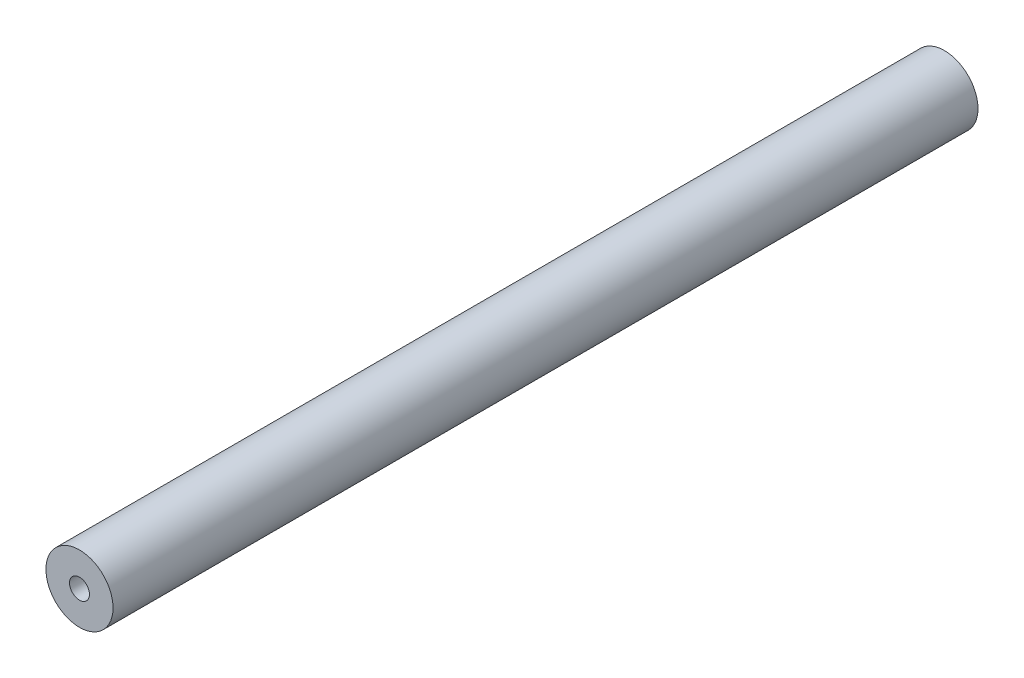
ISO-10303-21;
HEADER;
FILE_DESCRIPTION(('STEP AP214'),'2;1');
FILE_NAME('part.step','',(''),(''),'','','');
FILE_SCHEMA(('AUTOMOTIVE_DESIGN { 1 0 10303 214 1 1 1 1 }'));
ENDSEC;
DATA;
#1=APPLICATION_CONTEXT('core data for automotive mechanical design processes');
#2=APPLICATION_PROTOCOL_DEFINITION('international standard','automotive_design',2000,#1);
#3=PRODUCT_CONTEXT('',#1,'mechanical');
#4=PRODUCT('Part','Part','',(#3));
#5=PRODUCT_RELATED_PRODUCT_CATEGORY('part','',(#4));
#6=PRODUCT_DEFINITION_FORMATION('','',#4);
#7=PRODUCT_DEFINITION_CONTEXT('part definition',#1,'design');
#8=PRODUCT_DEFINITION('design','',#6,#7);
#9=PRODUCT_DEFINITION_SHAPE('','',#8);
#10=(LENGTH_UNIT() NAMED_UNIT(*) SI_UNIT(.MILLI.,.METRE.));
#11=(NAMED_UNIT(*) PLANE_ANGLE_UNIT() SI_UNIT($,.RADIAN.));
#12=(NAMED_UNIT(*) SI_UNIT($,.STERADIAN.) SOLID_ANGLE_UNIT());
#13=UNCERTAINTY_MEASURE_WITH_UNIT(LENGTH_MEASURE(1.E-05),#10,'distance_accuracy_value','');
#14=(GEOMETRIC_REPRESENTATION_CONTEXT(3) GLOBAL_UNCERTAINTY_ASSIGNED_CONTEXT((#13)) GLOBAL_UNIT_ASSIGNED_CONTEXT((#10,
#11,#12)) REPRESENTATION_CONTEXT('',''));
#15=CARTESIAN_POINT('',(0.,0.,0.));
#16=DIRECTION('',(0.,0.,1.));
#17=DIRECTION('',(1.,0.,0.));
#18=AXIS2_PLACEMENT_3D('',#15,#16,#17);
#19=CARTESIAN_POINT('',(0.,0.,165.));
#20=DIRECTION('',(0.,0.,-1.));
#21=DIRECTION('',(-1.,0.,0.));
#22=AXIS2_PLACEMENT_3D('',#19,#20,#21);
#23=CYLINDRICAL_SURFACE('',#22,6.4);
#24=CARTESIAN_POINT('',(0.,0.,165.));
#25=DIRECTION('',(0.,0.,1.));
#26=DIRECTION('',(1.,0.,0.));
#27=AXIS2_PLACEMENT_3D('',#24,#25,#26);
#28=CIRCLE('',#27,6.4);
#29=CARTESIAN_POINT('',(6.4,0.,165.));
#30=VERTEX_POINT('',#29);
#31=EDGE_CURVE('E11',#30,#30,#28,.T.);
#32=ORIENTED_EDGE('',*,*,#31,.F.);
#33=EDGE_LOOP('',(#32));
#34=FACE_BOUND('',#33,.T.);
#35=CARTESIAN_POINT('',(0.,0.,0.));
#36=DIRECTION('',(0.,0.,1.));
#37=DIRECTION('',(1.,0.,0.));
#38=AXIS2_PLACEMENT_3D('',#35,#36,#37);
#39=CIRCLE('',#38,6.4);
#40=CARTESIAN_POINT('',(6.4,0.,0.));
#41=VERTEX_POINT('',#40);
#42=EDGE_CURVE('E38',#41,#41,#39,.T.);
#43=ORIENTED_EDGE('',*,*,#42,.T.);
#44=EDGE_LOOP('',(#43));
#45=FACE_BOUND('',#44,.T.);
#46=ADVANCED_FACE('F35',(#34,#45),#23,.T.);
#47=CARTESIAN_POINT('',(0.,0.,165.));
#48=DIRECTION('',(0.,0.,1.));
#49=DIRECTION('',(1.,0.,0.));
#50=AXIS2_PLACEMENT_3D('',#47,#48,#49);
#51=PLANE('',#50);
#52=CARTESIAN_POINT('',(0.,0.,165.));
#53=DIRECTION('',(0.,0.,1.));
#54=DIRECTION('',(1.,0.,0.));
#55=AXIS2_PLACEMENT_3D('',#52,#53,#54);
#56=CIRCLE('',#55,1.89865);
#57=CARTESIAN_POINT('',(1.89865,0.,165.));
#58=VERTEX_POINT('',#57);
#59=EDGE_CURVE('E59',#58,#58,#56,.T.);
#60=ORIENTED_EDGE('',*,*,#59,.F.);
#61=EDGE_LOOP('',(#60));
#62=FACE_BOUND('',#61,.T.);
#63=ORIENTED_EDGE('',*,*,#31,.T.);
#64=EDGE_LOOP('',(#63));
#65=FACE_BOUND('',#64,.T.);
#66=ADVANCED_FACE('F77',(#62,#65),#51,.T.);
#67=CARTESIAN_POINT('',(0.,0.,0.));
#68=DIRECTION('',(0.,0.,1.));
#69=DIRECTION('',(1.,0.,0.));
#70=AXIS2_PLACEMENT_3D('',#67,#68,#69);
#71=PLANE('',#70);
#72=CARTESIAN_POINT('',(0.,0.,0.));
#73=DIRECTION('',(0.,0.,-1.));
#74=DIRECTION('',(-1.,0.,0.));
#75=AXIS2_PLACEMENT_3D('',#72,#73,#74);
#76=CIRCLE('',#75,1.89865);
#77=CARTESIAN_POINT('',(-1.89865,0.,0.));
#78=VERTEX_POINT('',#77);
#79=EDGE_CURVE('E58',#78,#78,#76,.T.);
#80=ORIENTED_EDGE('',*,*,#79,.F.);
#81=EDGE_LOOP('',(#80));
#82=FACE_BOUND('',#81,.T.);
#83=ORIENTED_EDGE('',*,*,#42,.F.);
#84=EDGE_LOOP('',(#83));
#85=FACE_BOUND('',#84,.T.);
#86=ADVANCED_FACE('F74',(#82,#85),#71,.F.);
#87=CARTESIAN_POINT('',(0.,0.,12.83));
#88=DIRECTION('',(0.,0.,-1.));
#89=DIRECTION('',(-1.,0.,0.));
#90=AXIS2_PLACEMENT_3D('',#87,#88,#89);
#91=CONICAL_SURFACE('',#90,1.89864999999999,1.02974425867665);
#92=CARTESIAN_POINT('',(0.,0.,13.9708240143167));
#93=VERTEX_POINT('',#92);
#94=VERTEX_LOOP('',#93);
#95=FACE_BOUND('',#94,.T.);
#96=CARTESIAN_POINT('',(0.,0.,12.83));
#97=DIRECTION('',(0.,0.,-1.));
#98=DIRECTION('',(-1.,0.,0.));
#99=AXIS2_PLACEMENT_3D('',#96,#97,#98);
#100=CIRCLE('',#99,1.89864999999999);
#101=CARTESIAN_POINT('',(-1.89864999999999,0.,12.83));
#102=VERTEX_POINT('',#101);
#103=EDGE_CURVE('E62',#102,#102,#100,.T.);
#104=ORIENTED_EDGE('',*,*,#103,.T.);
#105=EDGE_LOOP('',(#104));
#106=FACE_BOUND('',#105,.T.);
#107=ADVANCED_FACE('F76',(#95,#106),#91,.F.);
#108=CARTESIAN_POINT('',(0.,0.,0.));
#109=DIRECTION('',(0.,0.,-1.));
#110=DIRECTION('',(-1.,0.,0.));
#111=AXIS2_PLACEMENT_3D('',#108,#109,#110);
#112=CYLINDRICAL_SURFACE('',#111,1.89865);
#113=ORIENTED_EDGE('',*,*,#103,.F.);
#114=EDGE_LOOP('',(#113));
#115=FACE_BOUND('',#114,.T.);
#116=ORIENTED_EDGE('',*,*,#79,.T.);
#117=EDGE_LOOP('',(#116));
#118=FACE_BOUND('',#117,.T.);
#119=ADVANCED_FACE('F52',(#115,#118),#112,.F.);
#120=CARTESIAN_POINT('',(0.,0.,152.17));
#121=DIRECTION('',(0.,0.,1.));
#122=DIRECTION('',(1.,0.,0.));
#123=AXIS2_PLACEMENT_3D('',#120,#121,#122);
#124=CONICAL_SURFACE('',#123,1.89864999999999,1.02974425867665);
#125=CARTESIAN_POINT('',(0.,0.,151.029175985683));
#126=VERTEX_POINT('',#125);
#127=VERTEX_LOOP('',#126);
#128=FACE_BOUND('',#127,.T.);
#129=CARTESIAN_POINT('',(0.,0.,152.17));
#130=DIRECTION('',(0.,0.,1.));
#131=DIRECTION('',(1.,0.,0.));
#132=AXIS2_PLACEMENT_3D('',#129,#130,#131);
#133=CIRCLE('',#132,1.89864999999999);
#134=CARTESIAN_POINT('',(1.89864999999999,0.,152.17));
#135=VERTEX_POINT('',#134);
#136=EDGE_CURVE('E56',#135,#135,#133,.T.);
#137=ORIENTED_EDGE('',*,*,#136,.T.);
#138=EDGE_LOOP('',(#137));
#139=FACE_BOUND('',#138,.T.);
#140=ADVANCED_FACE('F48',(#128,#139),#124,.F.);
#141=CARTESIAN_POINT('',(0.,0.,165.));
#142=DIRECTION('',(0.,0.,1.));
#143=DIRECTION('',(1.,0.,0.));
#144=AXIS2_PLACEMENT_3D('',#141,#142,#143);
#145=CYLINDRICAL_SURFACE('',#144,1.89865);
#146=ORIENTED_EDGE('',*,*,#136,.F.);
#147=EDGE_LOOP('',(#146));
#148=FACE_BOUND('',#147,.T.);
#149=ORIENTED_EDGE('',*,*,#59,.T.);
#150=EDGE_LOOP('',(#149));
#151=FACE_BOUND('',#150,.T.);
#152=ADVANCED_FACE('F51',(#148,#151),#145,.F.);
#153=CLOSED_SHELL('',(#46,#66,#86,#107,#119,#140,#152));
#154=MANIFOLD_SOLID_BREP('B2',#153);
#155=ADVANCED_BREP_SHAPE_REPRESENTATION('',(#18,#154),#14);
#156=SHAPE_DEFINITION_REPRESENTATION(#9,#155);
ENDSEC;
END-ISO-10303-21;
